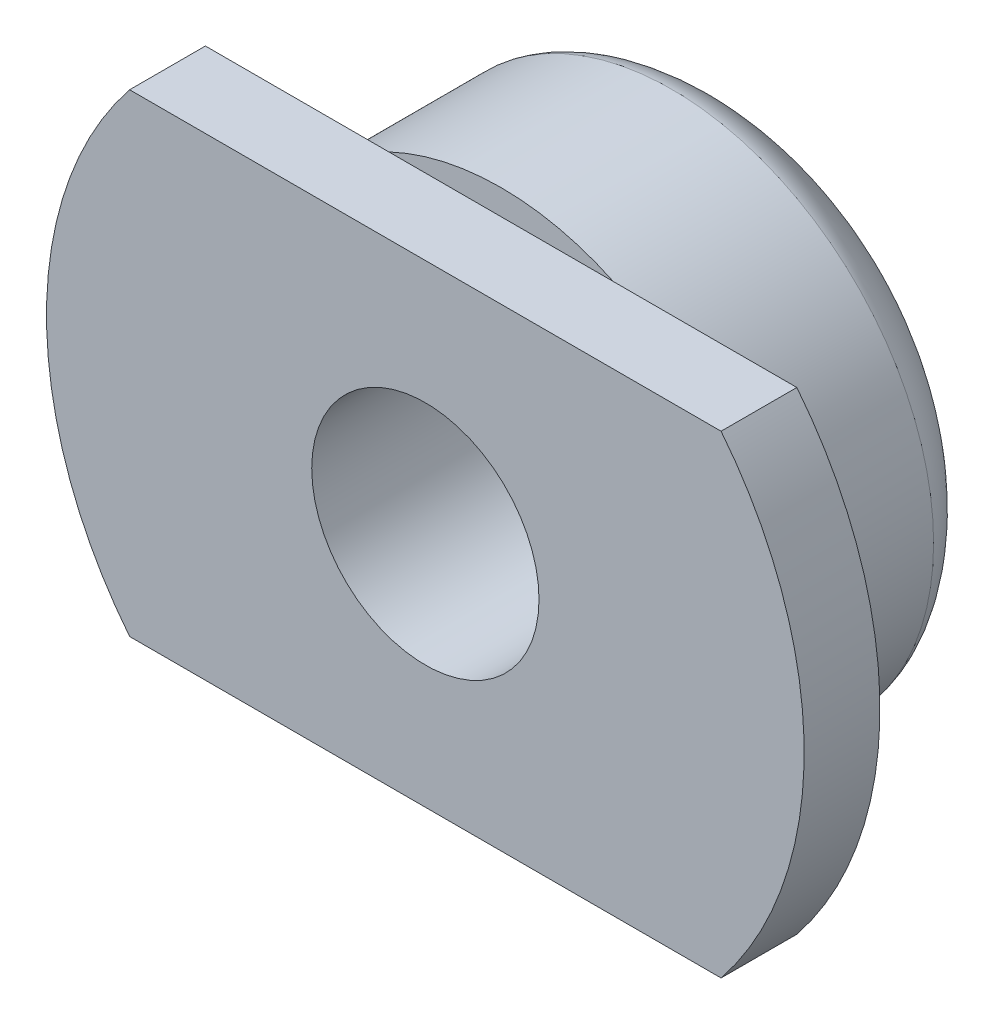
ISO-10303-21;
HEADER;
FILE_DESCRIPTION(('STEP AP214'),'2;1');
FILE_NAME('part.step','',(''),(''),'','','');
FILE_SCHEMA(('AUTOMOTIVE_DESIGN { 1 0 10303 214 1 1 1 1 }'));
ENDSEC;
DATA;
#1=APPLICATION_CONTEXT('core data for automotive mechanical design processes');
#2=APPLICATION_PROTOCOL_DEFINITION('international standard','automotive_design',2000,#1);
#3=PRODUCT_CONTEXT('',#1,'mechanical');
#4=PRODUCT('Part','Part','',(#3));
#5=PRODUCT_RELATED_PRODUCT_CATEGORY('part','',(#4));
#6=PRODUCT_DEFINITION_FORMATION('','',#4);
#7=PRODUCT_DEFINITION_CONTEXT('part definition',#1,'design');
#8=PRODUCT_DEFINITION('design','',#6,#7);
#9=PRODUCT_DEFINITION_SHAPE('','',#8);
#10=(LENGTH_UNIT() NAMED_UNIT(*) SI_UNIT(.MILLI.,.METRE.));
#11=(NAMED_UNIT(*) PLANE_ANGLE_UNIT() SI_UNIT($,.RADIAN.));
#12=(NAMED_UNIT(*) SI_UNIT($,.STERADIAN.) SOLID_ANGLE_UNIT());
#13=UNCERTAINTY_MEASURE_WITH_UNIT(LENGTH_MEASURE(1.E-05),#10,'distance_accuracy_value','');
#14=(GEOMETRIC_REPRESENTATION_CONTEXT(3) GLOBAL_UNCERTAINTY_ASSIGNED_CONTEXT((#13)) GLOBAL_UNIT_ASSIGNED_CONTEXT((#10,
#11,#12)) REPRESENTATION_CONTEXT('',''));
#15=CARTESIAN_POINT('',(0.,0.,0.));
#16=DIRECTION('',(0.,0.,1.));
#17=DIRECTION('',(1.,0.,0.));
#18=AXIS2_PLACEMENT_3D('',#15,#16,#17);
#19=CARTESIAN_POINT('',(0.,0.,5.4));
#20=DIRECTION('',(0.,0.,-1.));
#21=DIRECTION('',(-1.,0.,0.));
#22=AXIS2_PLACEMENT_3D('',#19,#20,#21);
#23=CYLINDRICAL_SURFACE('',#22,6.);
#24=DIRECTION('',(0.,0.,-1.));
#25=VECTOR('',#24,1.);
#26=CARTESIAN_POINT('',(4.6837484987988,3.75,5.4));
#27=LINE('',#26,#25);
#28=CARTESIAN_POINT('',(4.6837484987988,3.75,5.4));
#29=VERTEX_POINT('',#28);
#30=CARTESIAN_POINT('',(4.6837484987988,3.75,4.2));
#31=VERTEX_POINT('',#30);
#32=EDGE_CURVE('E124',#29,#31,#27,.T.);
#33=ORIENTED_EDGE('',*,*,#32,.F.);
#34=CARTESIAN_POINT('',(0.,0.,5.4));
#35=DIRECTION('',(0.,0.,1.));
#36=DIRECTION('',(1.,0.,0.));
#37=AXIS2_PLACEMENT_3D('',#34,#35,#36);
#38=CIRCLE('',#37,6.);
#39=CARTESIAN_POINT('',(4.6837484987988,-3.75,5.4));
#40=VERTEX_POINT('',#39);
#41=EDGE_CURVE('E117',#40,#29,#38,.T.);
#42=ORIENTED_EDGE('',*,*,#41,.F.);
#43=DIRECTION('',(0.,0.,-1.));
#44=VECTOR('',#43,1.);
#45=CARTESIAN_POINT('',(4.6837484987988,-3.75,5.4));
#46=LINE('',#45,#44);
#47=CARTESIAN_POINT('',(4.6837484987988,-3.75,4.2));
#48=VERTEX_POINT('',#47);
#49=EDGE_CURVE('E96',#48,#40,#46,.F.);
#50=ORIENTED_EDGE('',*,*,#49,.F.);
#51=CARTESIAN_POINT('',(0.,0.,4.2));
#52=DIRECTION('',(0.,0.,1.));
#53=DIRECTION('',(1.,0.,0.));
#54=AXIS2_PLACEMENT_3D('',#51,#52,#53);
#55=CIRCLE('',#54,6.);
#56=EDGE_CURVE('E126',#48,#31,#55,.T.);
#57=ORIENTED_EDGE('',*,*,#56,.T.);
#58=EDGE_LOOP('',(#33,#42,#50,#57));
#59=FACE_BOUND('',#58,.T.);
#60=ADVANCED_FACE('F40',(#59),#23,.T.);
#61=DIRECTION('',(0.,0.,-1.));
#62=VECTOR('',#61,1.);
#63=CARTESIAN_POINT('',(-4.6837484987988,3.75,5.4));
#64=LINE('',#63,#62);
#65=CARTESIAN_POINT('',(-4.6837484987988,3.75,4.2));
#66=VERTEX_POINT('',#65);
#67=CARTESIAN_POINT('',(-4.6837484987988,3.75,5.4));
#68=VERTEX_POINT('',#67);
#69=EDGE_CURVE('E112',#66,#68,#64,.F.);
#70=ORIENTED_EDGE('',*,*,#69,.F.);
#71=CARTESIAN_POINT('',(-4.6837484987988,-3.75,4.2));
#72=VERTEX_POINT('',#71);
#73=EDGE_CURVE('E111',#66,#72,#55,.T.);
#74=ORIENTED_EDGE('',*,*,#73,.T.);
#75=DIRECTION('',(0.,0.,-1.));
#76=VECTOR('',#75,1.);
#77=CARTESIAN_POINT('',(-4.6837484987988,-3.75,5.4));
#78=LINE('',#77,#76);
#79=CARTESIAN_POINT('',(-4.6837484987988,-3.75,5.4));
#80=VERTEX_POINT('',#79);
#81=EDGE_CURVE('E93',#80,#72,#78,.T.);
#82=ORIENTED_EDGE('',*,*,#81,.F.);
#83=EDGE_CURVE('E109',#68,#80,#38,.T.);
#84=ORIENTED_EDGE('',*,*,#83,.F.);
#85=EDGE_LOOP('',(#70,#74,#82,#84));
#86=FACE_BOUND('',#85,.T.);
#87=ADVANCED_FACE('F108',(#86),#23,.T.);
#88=CARTESIAN_POINT('',(0.,0.,5.4));
#89=DIRECTION('',(0.,0.,1.));
#90=DIRECTION('',(1.,0.,0.));
#91=AXIS2_PLACEMENT_3D('',#88,#89,#90);
#92=PLANE('',#91);
#93=CARTESIAN_POINT('',(0.000210646153013527,-7.86805516572731E-08,5.4));
#94=DIRECTION('',(0.,0.,1.));
#95=DIRECTION('',(1.,0.,0.));
#96=AXIS2_PLACEMENT_3D('',#93,#94,#95);
#97=CIRCLE('',#96,1.8);
#98=CARTESIAN_POINT('',(1.80021064615301,-7.86805516572731E-08,5.4));
#99=VERTEX_POINT('',#98);
#100=EDGE_CURVE('E164',#99,#99,#97,.T.);
#101=ORIENTED_EDGE('',*,*,#100,.F.);
#102=EDGE_LOOP('',(#101));
#103=FACE_BOUND('',#102,.T.);
#104=ORIENTED_EDGE('',*,*,#41,.T.);
#105=DIRECTION('',(-1.,0.,0.));
#106=VECTOR('',#105,1.);
#107=CARTESIAN_POINT('',(6.5,3.75,5.4));
#108=LINE('',#107,#106);
#109=EDGE_CURVE('E101',#29,#68,#108,.T.);
#110=ORIENTED_EDGE('',*,*,#109,.T.);
#111=ORIENTED_EDGE('',*,*,#83,.T.);
#112=DIRECTION('',(1.,0.,0.));
#113=VECTOR('',#112,1.);
#114=CARTESIAN_POINT('',(6.5,-3.75,5.4));
#115=LINE('',#114,#113);
#116=EDGE_CURVE('E90',#80,#40,#115,.T.);
#117=ORIENTED_EDGE('',*,*,#116,.T.);
#118=EDGE_LOOP('',(#104,#110,#111,#117));
#119=FACE_BOUND('',#118,.T.);
#120=ADVANCED_FACE('F115',(#103,#119),#92,.T.);
#121=CARTESIAN_POINT('',(0.,0.,4.2));
#122=DIRECTION('',(0.,0.,1.));
#123=DIRECTION('',(1.,0.,0.));
#124=AXIS2_PLACEMENT_3D('',#121,#122,#123);
#125=PLANE('',#124);
#126=DIRECTION('',(-1.,0.,0.));
#127=VECTOR('',#126,1.);
#128=CARTESIAN_POINT('',(0.,3.75,4.2));
#129=LINE('',#128,#127);
#130=CARTESIAN_POINT('',(1.77763888346312,3.75,4.2));
#131=VERTEX_POINT('',#130);
#132=EDGE_CURVE('E12',#31,#131,#129,.T.);
#133=ORIENTED_EDGE('',*,*,#132,.F.);
#134=ORIENTED_EDGE('',*,*,#56,.F.);
#135=DIRECTION('',(1.,0.,0.));
#136=VECTOR('',#135,1.);
#137=CARTESIAN_POINT('',(0.,-3.75,4.2));
#138=LINE('',#137,#136);
#139=CARTESIAN_POINT('',(1.77763888346312,-3.75,4.2));
#140=VERTEX_POINT('',#139);
#141=EDGE_CURVE('E276',#140,#48,#138,.T.);
#142=ORIENTED_EDGE('',*,*,#141,.F.);
#143=CARTESIAN_POINT('',(0.,0.,4.2));
#144=DIRECTION('',(0.,0.,1.));
#145=DIRECTION('',(1.,0.,0.));
#146=AXIS2_PLACEMENT_3D('',#143,#144,#145);
#147=CIRCLE('',#146,4.15);
#148=EDGE_CURVE('E272',#140,#131,#147,.T.);
#149=ORIENTED_EDGE('',*,*,#148,.T.);
#150=EDGE_LOOP('',(#133,#134,#142,#149));
#151=FACE_BOUND('',#150,.T.);
#152=ADVANCED_FACE('F180',(#151),#125,.F.);
#153=CARTESIAN_POINT('',(-1.77763888346312,3.75,4.2));
#154=VERTEX_POINT('',#153);
#155=EDGE_CURVE('E44',#154,#66,#129,.T.);
#156=ORIENTED_EDGE('',*,*,#155,.F.);
#157=CARTESIAN_POINT('',(-1.77763888346311,-3.75,4.2));
#158=VERTEX_POINT('',#157);
#159=EDGE_CURVE('E274',#154,#158,#147,.T.);
#160=ORIENTED_EDGE('',*,*,#159,.T.);
#161=EDGE_CURVE('E278',#72,#158,#138,.T.);
#162=ORIENTED_EDGE('',*,*,#161,.F.);
#163=ORIENTED_EDGE('',*,*,#73,.F.);
#164=EDGE_LOOP('',(#156,#160,#162,#163));
#165=FACE_BOUND('',#164,.T.);
#166=ADVANCED_FACE('F185',(#165),#125,.F.);
#167=CARTESIAN_POINT('',(0.,0.,17.2));
#168=DIRECTION('',(0.,0.,-1.));
#169=DIRECTION('',(-1.,0.,0.));
#170=AXIS2_PLACEMENT_3D('',#167,#168,#169);
#171=CYLINDRICAL_SURFACE('',#170,4.15);
#172=CARTESIAN_POINT('',(0.,0.,1.50000000000001));
#173=DIRECTION('',(0.,0.,-1.));
#174=DIRECTION('',(-1.,0.,0.));
#175=AXIS2_PLACEMENT_3D('',#172,#173,#174);
#176=CIRCLE('',#175,4.15);
#177=CARTESIAN_POINT('',(-4.15,0.,1.50000000000001));
#178=VERTEX_POINT('',#177);
#179=EDGE_CURVE('E120',#178,#178,#176,.T.);
#180=ORIENTED_EDGE('',*,*,#179,.F.);
#181=EDGE_LOOP('',(#180));
#182=FACE_BOUND('',#181,.T.);
#183=EDGE_CURVE('E269',#131,#154,#147,.T.);
#184=ORIENTED_EDGE('',*,*,#183,.F.);
#185=ORIENTED_EDGE('',*,*,#148,.F.);
#186=EDGE_CURVE('E279',#158,#140,#147,.T.);
#187=ORIENTED_EDGE('',*,*,#186,.F.);
#188=ORIENTED_EDGE('',*,*,#159,.F.);
#189=EDGE_LOOP('',(#184,#185,#187,#188));
#190=FACE_BOUND('',#189,.T.);
#191=ADVANCED_FACE('F42',(#182,#190),#171,.T.);
#192=CARTESIAN_POINT('',(0.,4.15,1.50000000000001));
#193=CARTESIAN_POINT('',(0.,4.05537317860218,0.922815805737262));
#194=CARTESIAN_POINT('',(0.,2.84655662610956,-0.00317399949750981));
#195=CARTESIAN_POINT('',(0.,1.43187539710622,0.));
#196=B_SPLINE_CURVE_WITH_KNOTS('',3,(#192,#193,#194,#195),.UNSPECIFIED.,.F.,.F.,(4,4),(0.,
0.91074495904114),.UNSPECIFIED.);
#197=CARTESIAN_POINT('',(0.,0.,0.));
#198=DIRECTION('',(0.,0.,-1.));
#199=AXIS1_PLACEMENT('',#197,#198);
#200=SURFACE_OF_REVOLUTION('',#196,#199);
#201=CARTESIAN_POINT('',(0.,0.,0.));
#202=DIRECTION('',(0.,0.,-1.));
#203=DIRECTION('',(-1.,0.,0.));
#204=AXIS2_PLACEMENT_3D('',#201,#202,#203);
#205=CIRCLE('',#204,1.43187539710622);
#206=CARTESIAN_POINT('',(-1.43187539710622,0.,0.));
#207=VERTEX_POINT('',#206);
#208=EDGE_CURVE('E116',#207,#207,#205,.T.);
#209=ORIENTED_EDGE('',*,*,#208,.F.);
#210=EDGE_LOOP('',(#209));
#211=FACE_BOUND('',#210,.T.);
#212=ORIENTED_EDGE('',*,*,#179,.T.);
#213=EDGE_LOOP('',(#212));
#214=FACE_BOUND('',#213,.T.);
#215=ADVANCED_FACE('F137',(#211,#214),#200,.T.);
#216=CARTESIAN_POINT('',(0.,0.,0.));
#217=DIRECTION('',(0.,0.,1.));
#218=DIRECTION('',(1.,0.,0.));
#219=AXIS2_PLACEMENT_3D('',#216,#217,#218);
#220=PLANE('',#219);
#221=ORIENTED_EDGE('',*,*,#208,.T.);
#222=EDGE_LOOP('',(#221));
#223=FACE_BOUND('',#222,.T.);
#224=ADVANCED_FACE('F140',(#223),#220,.F.);
#225=CARTESIAN_POINT('',(6.5,-3.75,4.2));
#226=DIRECTION('',(0.,-1.,0.));
#227=DIRECTION('',(1.,0.,0.));
#228=AXIS2_PLACEMENT_3D('',#225,#226,#227);
#229=PLANE('',#228);
#230=ORIENTED_EDGE('',*,*,#81,.T.);
#231=ORIENTED_EDGE('',*,*,#161,.T.);
#232=DIRECTION('',(1.,0.,0.));
#233=VECTOR('',#232,1.);
#234=CARTESIAN_POINT('',(6.5,-3.75,4.2));
#235=LINE('',#234,#233);
#236=EDGE_CURVE('E55',#158,#140,#235,.T.);
#237=ORIENTED_EDGE('',*,*,#236,.T.);
#238=ORIENTED_EDGE('',*,*,#141,.T.);
#239=ORIENTED_EDGE('',*,*,#49,.T.);
#240=ORIENTED_EDGE('',*,*,#116,.F.);
#241=EDGE_LOOP('',(#230,#231,#237,#238,#239,#240));
#242=FACE_BOUND('',#241,.T.);
#243=ADVANCED_FACE('F92',(#242),#229,.T.);
#244=CARTESIAN_POINT('',(0.,0.,4.2));
#245=DIRECTION('',(0.,0.,1.));
#246=DIRECTION('',(1.,0.,0.));
#247=AXIS2_PLACEMENT_3D('',#244,#245,#246);
#248=PLANE('',#247);
#249=ORIENTED_EDGE('',*,*,#186,.T.);
#250=ORIENTED_EDGE('',*,*,#236,.F.);
#251=EDGE_LOOP('',(#249,#250));
#252=FACE_BOUND('',#251,.T.);
#253=ADVANCED_FACE('F149',(#252),#248,.T.);
#254=ORIENTED_EDGE('',*,*,#183,.T.);
#255=DIRECTION('',(-1.,0.,0.));
#256=VECTOR('',#255,1.);
#257=CARTESIAN_POINT('',(6.5,3.75,4.2));
#258=LINE('',#257,#256);
#259=EDGE_CURVE('E62',#131,#154,#258,.T.);
#260=ORIENTED_EDGE('',*,*,#259,.F.);
#261=EDGE_LOOP('',(#254,#260));
#262=FACE_BOUND('',#261,.T.);
#263=ADVANCED_FACE('F188',(#262),#248,.T.);
#264=CARTESIAN_POINT('',(6.5,3.75,4.2));
#265=DIRECTION('',(0.,1.,0.));
#266=DIRECTION('',(-1.,0.,0.));
#267=AXIS2_PLACEMENT_3D('',#264,#265,#266);
#268=PLANE('',#267);
#269=ORIENTED_EDGE('',*,*,#32,.T.);
#270=ORIENTED_EDGE('',*,*,#132,.T.);
#271=ORIENTED_EDGE('',*,*,#259,.T.);
#272=ORIENTED_EDGE('',*,*,#155,.T.);
#273=ORIENTED_EDGE('',*,*,#69,.T.);
#274=ORIENTED_EDGE('',*,*,#109,.F.);
#275=EDGE_LOOP('',(#269,#270,#271,#272,#273,#274));
#276=FACE_BOUND('',#275,.T.);
#277=ADVANCED_FACE('F175',(#276),#268,.T.);
#278=CARTESIAN_POINT('',(0.000210646153013527,-7.86805516572731E-08,1.4));
#279=DIRECTION('',(0.,0.,1.));
#280=DIRECTION('',(1.,0.,0.));
#281=AXIS2_PLACEMENT_3D('',#278,#279,#280);
#282=CYLINDRICAL_SURFACE('',#281,1.8);
#283=CARTESIAN_POINT('',(0.000210646153013527,-7.86805516572731E-08,1.4));
#284=DIRECTION('',(0.,0.,1.));
#285=DIRECTION('',(1.,0.,0.));
#286=AXIS2_PLACEMENT_3D('',#283,#284,#285);
#287=CIRCLE('',#286,1.8);
#288=CARTESIAN_POINT('',(1.80021064615301,-7.86805516572731E-08,1.4));
#289=VERTEX_POINT('',#288);
#290=EDGE_CURVE('E102',#289,#289,#287,.T.);
#291=ORIENTED_EDGE('',*,*,#290,.F.);
#292=EDGE_LOOP('',(#291));
#293=FACE_BOUND('',#292,.T.);
#294=ORIENTED_EDGE('',*,*,#100,.T.);
#295=EDGE_LOOP('',(#294));
#296=FACE_BOUND('',#295,.T.);
#297=ADVANCED_FACE('F172',(#293,#296),#282,.F.);
#298=CARTESIAN_POINT('',(0.000210646153013527,-7.86805516572731E-08,1.4));
#299=DIRECTION('',(0.,0.,1.));
#300=DIRECTION('',(1.,0.,0.));
#301=AXIS2_PLACEMENT_3D('',#298,#299,#300);
#302=PLANE('',#301);
#303=ORIENTED_EDGE('',*,*,#290,.T.);
#304=EDGE_LOOP('',(#303));
#305=FACE_BOUND('',#304,.T.);
#306=ADVANCED_FACE('F170',(#305),#302,.T.);
#307=CLOSED_SHELL('',(#60,#87,#120,#152,#166,#191,#215,#224,#243,#253,#263,#277,#297,#306));
#308=MANIFOLD_SOLID_BREP('B2',#307);
#309=ADVANCED_BREP_SHAPE_REPRESENTATION('',(#18,#308),#14);
#310=SHAPE_DEFINITION_REPRESENTATION(#9,#309);
ENDSEC;
END-ISO-10303-21;
